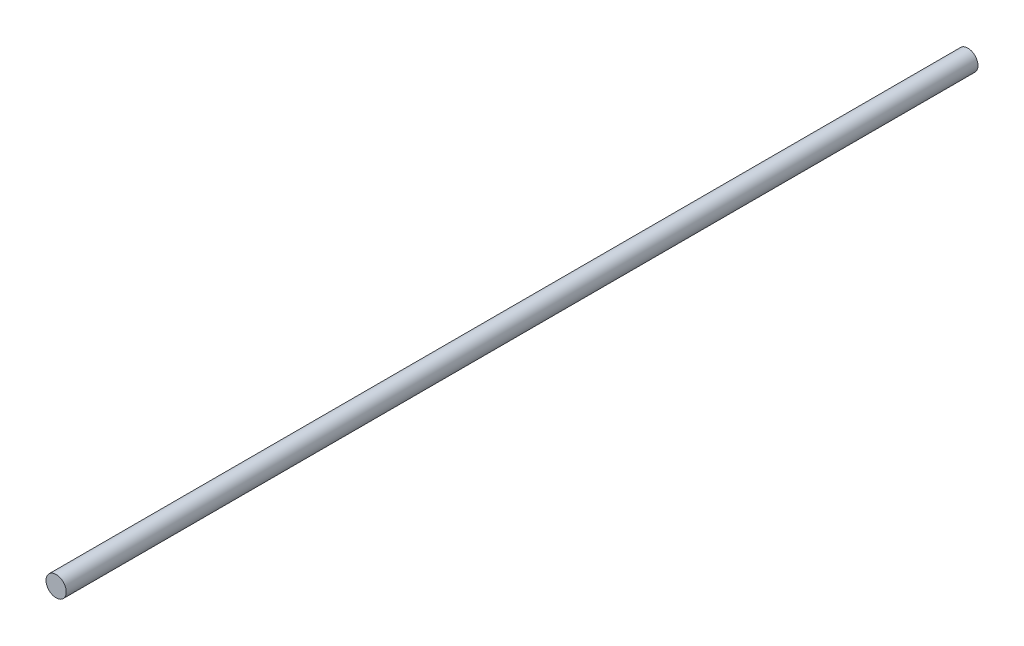
ISO-10303-21;
HEADER;
FILE_DESCRIPTION(('STEP AP214'),'2;1');
FILE_NAME('part.step','',(''),(''),'','','');
FILE_SCHEMA(('AUTOMOTIVE_DESIGN { 1 0 10303 214 1 1 1 1 }'));
ENDSEC;
DATA;
#1=APPLICATION_CONTEXT('core data for automotive mechanical design processes');
#2=APPLICATION_PROTOCOL_DEFINITION('international standard','automotive_design',2000,#1);
#3=PRODUCT_CONTEXT('',#1,'mechanical');
#4=PRODUCT('Part','Part','',(#3));
#5=PRODUCT_RELATED_PRODUCT_CATEGORY('part','',(#4));
#6=PRODUCT_DEFINITION_FORMATION('','',#4);
#7=PRODUCT_DEFINITION_CONTEXT('part definition',#1,'design');
#8=PRODUCT_DEFINITION('design','',#6,#7);
#9=PRODUCT_DEFINITION_SHAPE('','',#8);
#10=(LENGTH_UNIT() NAMED_UNIT(*) SI_UNIT(.MILLI.,.METRE.));
#11=(NAMED_UNIT(*) PLANE_ANGLE_UNIT() SI_UNIT($,.RADIAN.));
#12=(NAMED_UNIT(*) SI_UNIT($,.STERADIAN.) SOLID_ANGLE_UNIT());
#13=UNCERTAINTY_MEASURE_WITH_UNIT(LENGTH_MEASURE(1.E-05),#10,'distance_accuracy_value','');
#14=(GEOMETRIC_REPRESENTATION_CONTEXT(3) GLOBAL_UNCERTAINTY_ASSIGNED_CONTEXT((#13)) GLOBAL_UNIT_ASSIGNED_CONTEXT((#10,
#11,#12)) REPRESENTATION_CONTEXT('',''));
#15=CARTESIAN_POINT('',(0.,0.,0.));
#16=DIRECTION('',(0.,0.,1.));
#17=DIRECTION('',(1.,0.,0.));
#18=AXIS2_PLACEMENT_3D('',#15,#16,#17);
#19=CARTESIAN_POINT('',(0.,0.,270.));
#20=DIRECTION('',(0.,0.,-1.));
#21=DIRECTION('',(-1.,0.,0.));
#22=AXIS2_PLACEMENT_3D('',#19,#20,#21);
#23=CYLINDRICAL_SURFACE('',#22,3.);
#24=CARTESIAN_POINT('',(0.,0.,270.));
#25=DIRECTION('',(0.,0.,1.));
#26=DIRECTION('',(1.,0.,0.));
#27=AXIS2_PLACEMENT_3D('',#24,#25,#26);
#28=CIRCLE('',#27,3.);
#29=CARTESIAN_POINT('',(3.,0.,270.));
#30=VERTEX_POINT('',#29);
#31=EDGE_CURVE('E10',#30,#30,#28,.T.);
#32=ORIENTED_EDGE('',*,*,#31,.F.);
#33=EDGE_LOOP('',(#32));
#34=FACE_BOUND('',#33,.T.);
#35=CARTESIAN_POINT('',(0.,0.,0.));
#36=DIRECTION('',(0.,0.,1.));
#37=DIRECTION('',(1.,0.,0.));
#38=AXIS2_PLACEMENT_3D('',#35,#36,#37);
#39=CIRCLE('',#38,3.);
#40=CARTESIAN_POINT('',(3.,0.,0.));
#41=VERTEX_POINT('',#40);
#42=EDGE_CURVE('E32',#41,#41,#39,.T.);
#43=ORIENTED_EDGE('',*,*,#42,.T.);
#44=EDGE_LOOP('',(#43));
#45=FACE_BOUND('',#44,.T.);
#46=ADVANCED_FACE('F29',(#34,#45),#23,.T.);
#47=CARTESIAN_POINT('',(0.,0.,270.));
#48=DIRECTION('',(0.,0.,1.));
#49=DIRECTION('',(1.,0.,0.));
#50=AXIS2_PLACEMENT_3D('',#47,#48,#49);
#51=PLANE('',#50);
#52=ORIENTED_EDGE('',*,*,#31,.T.);
#53=EDGE_LOOP('',(#52));
#54=FACE_BOUND('',#53,.T.);
#55=ADVANCED_FACE('F44',(#54),#51,.T.);
#56=CARTESIAN_POINT('',(0.,0.,0.));
#57=DIRECTION('',(0.,0.,1.));
#58=DIRECTION('',(1.,0.,0.));
#59=AXIS2_PLACEMENT_3D('',#56,#57,#58);
#60=PLANE('',#59);
#61=ORIENTED_EDGE('',*,*,#42,.F.);
#62=EDGE_LOOP('',(#61));
#63=FACE_BOUND('',#62,.T.);
#64=ADVANCED_FACE('F42',(#63),#60,.F.);
#65=CLOSED_SHELL('',(#46,#55,#64));
#66=MANIFOLD_SOLID_BREP('B2',#65);
#67=ADVANCED_BREP_SHAPE_REPRESENTATION('',(#18,#66),#14);
#68=SHAPE_DEFINITION_REPRESENTATION(#9,#67);
ENDSEC;
END-ISO-10303-21;
